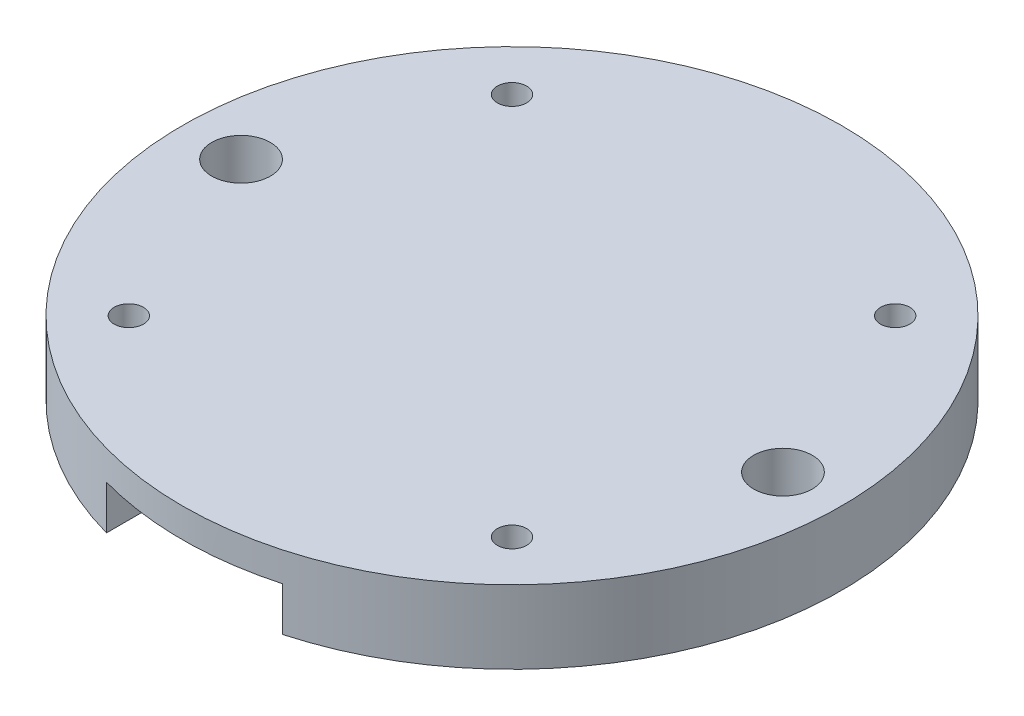
ISO-10303-21;
HEADER;
FILE_DESCRIPTION(('STEP AP214'),'2;1');
FILE_NAME('part.step','',(''),(''),'','','');
FILE_SCHEMA(('AUTOMOTIVE_DESIGN { 1 0 10303 214 1 1 1 1 }'));
ENDSEC;
DATA;
#1=APPLICATION_CONTEXT('core data for automotive mechanical design processes');
#2=APPLICATION_PROTOCOL_DEFINITION('international standard','automotive_design',2000,#1);
#3=PRODUCT_CONTEXT('',#1,'mechanical');
#4=PRODUCT('Part','Part','',(#3));
#5=PRODUCT_RELATED_PRODUCT_CATEGORY('part','',(#4));
#6=PRODUCT_DEFINITION_FORMATION('','',#4);
#7=PRODUCT_DEFINITION_CONTEXT('part definition',#1,'design');
#8=PRODUCT_DEFINITION('design','',#6,#7);
#9=PRODUCT_DEFINITION_SHAPE('','',#8);
#10=(LENGTH_UNIT() NAMED_UNIT(*) SI_UNIT(.MILLI.,.METRE.));
#11=(NAMED_UNIT(*) PLANE_ANGLE_UNIT() SI_UNIT($,.RADIAN.));
#12=(NAMED_UNIT(*) SI_UNIT($,.STERADIAN.) SOLID_ANGLE_UNIT());
#13=UNCERTAINTY_MEASURE_WITH_UNIT(LENGTH_MEASURE(1.E-05),#10,'distance_accuracy_value','');
#14=(GEOMETRIC_REPRESENTATION_CONTEXT(3) GLOBAL_UNCERTAINTY_ASSIGNED_CONTEXT((#13)) GLOBAL_UNIT_ASSIGNED_CONTEXT((#10,
#11,#12)) REPRESENTATION_CONTEXT('',''));
#15=CARTESIAN_POINT('',(0.,0.,0.));
#16=DIRECTION('',(0.,0.,1.));
#17=DIRECTION('',(1.,0.,0.));
#18=AXIS2_PLACEMENT_3D('',#15,#16,#17);
#19=CARTESIAN_POINT('',(0.,0.,0.));
#20=DIRECTION('',(0.,1.,0.));
#21=DIRECTION('',(0.,0.,1.));
#22=AXIS2_PLACEMENT_3D('',#19,#20,#21);
#23=PLANE('',#22);
#24=CARTESIAN_POINT('',(13.0814754519511,0.,13.0814754519512));
#25=DIRECTION('',(0.,1.,0.));
#26=DIRECTION('',(0.,0.,-1.));
#27=AXIS2_PLACEMENT_3D('',#24,#25,#26);
#28=CIRCLE('',#27,1.00000000000002);
#29=CARTESIAN_POINT('',(13.0814754519511,0.,12.0814754519511));
#30=VERTEX_POINT('',#29);
#31=EDGE_CURVE('E228',#30,#30,#28,.T.);
#32=ORIENTED_EDGE('',*,*,#31,.T.);
#33=EDGE_LOOP('',(#32));
#34=FACE_BOUND('',#33,.T.);
#35=CARTESIAN_POINT('',(13.0814754519511,0.,-13.0814754519512));
#36=DIRECTION('',(0.,1.,0.));
#37=DIRECTION('',(0.,0.,1.));
#38=AXIS2_PLACEMENT_3D('',#35,#36,#37);
#39=CIRCLE('',#38,1.00000000000002);
#40=CARTESIAN_POINT('',(13.0814754519511,0.,-12.0814754519511));
#41=VERTEX_POINT('',#40);
#42=EDGE_CURVE('E147',#41,#41,#39,.T.);
#43=ORIENTED_EDGE('',*,*,#42,.T.);
#44=EDGE_LOOP('',(#43));
#45=FACE_BOUND('',#44,.T.);
#46=CARTESIAN_POINT('',(18.5,0.,0.));
#47=DIRECTION('',(0.,1.,0.));
#48=DIRECTION('',(0.,0.,1.));
#49=AXIS2_PLACEMENT_3D('',#46,#47,#48);
#50=CIRCLE('',#49,2.);
#51=CARTESIAN_POINT('',(18.5,0.,2.));
#52=VERTEX_POINT('',#51);
#53=EDGE_CURVE('E126',#52,#52,#50,.T.);
#54=ORIENTED_EDGE('',*,*,#53,.T.);
#55=EDGE_LOOP('',(#54));
#56=FACE_BOUND('',#55,.T.);
#57=CARTESIAN_POINT('',(0.,0.,0.));
#58=DIRECTION('',(0.,1.,0.));
#59=DIRECTION('',(0.,0.,1.));
#60=AXIS2_PLACEMENT_3D('',#57,#58,#59);
#61=CIRCLE('',#60,22.5);
#62=CARTESIAN_POINT('',(6.,0.,21.6852484422014));
#63=VERTEX_POINT('',#62);
#64=CARTESIAN_POINT('',(6.,0.,-21.6852484422014));
#65=VERTEX_POINT('',#64);
#66=EDGE_CURVE('E120',#63,#65,#61,.T.);
#67=ORIENTED_EDGE('',*,*,#66,.F.);
#68=DIRECTION('',(0.,0.,1.));
#69=VECTOR('',#68,1.);
#70=CARTESIAN_POINT('',(6.,0.,-22.5));
#71=LINE('',#70,#69);
#72=CARTESIAN_POINT('',(6.,0.,8.31038506929733));
#73=VERTEX_POINT('',#72);
#74=EDGE_CURVE('E108',#73,#63,#71,.T.);
#75=ORIENTED_EDGE('',*,*,#74,.F.);
#76=CARTESIAN_POINT('',(0.,0.,0.));
#77=DIRECTION('',(0.,1.,0.));
#78=DIRECTION('',(0.,0.,1.));
#79=AXIS2_PLACEMENT_3D('',#76,#77,#78);
#80=CIRCLE('',#79,10.25);
#81=CARTESIAN_POINT('',(6.,0.,-8.31038506929733));
#82=VERTEX_POINT('',#81);
#83=EDGE_CURVE('E166',#73,#82,#80,.T.);
#84=ORIENTED_EDGE('',*,*,#83,.T.);
#85=EDGE_CURVE('E152',#65,#82,#71,.T.);
#86=ORIENTED_EDGE('',*,*,#85,.F.);
#87=EDGE_LOOP('',(#67,#75,#84,#86));
#88=FACE_BOUND('',#87,.T.);
#89=ADVANCED_FACE('F33',(#34,#45,#56,#88),#23,.F.);
#90=CARTESIAN_POINT('',(0.,1.,0.));
#91=DIRECTION('',(0.,-1.,0.));
#92=DIRECTION('',(0.,0.,-1.));
#93=AXIS2_PLACEMENT_3D('',#90,#91,#92);
#94=CYLINDRICAL_SURFACE('',#93,10.25);
#95=DIRECTION('',(0.,-1.,0.));
#96=VECTOR('',#95,1.);
#97=CARTESIAN_POINT('',(6.,1.,8.31038506929733));
#98=LINE('',#97,#96);
#99=CARTESIAN_POINT('',(6.,1.,8.31038506929733));
#100=VERTEX_POINT('',#99);
#101=EDGE_CURVE('E156',#100,#73,#98,.T.);
#102=ORIENTED_EDGE('',*,*,#101,.F.);
#103=CARTESIAN_POINT('',(0.,1.,0.));
#104=DIRECTION('',(0.,1.,0.));
#105=DIRECTION('',(0.,0.,1.));
#106=AXIS2_PLACEMENT_3D('',#103,#104,#105);
#107=CIRCLE('',#106,10.25);
#108=CARTESIAN_POINT('',(6.,1.,-8.31038506929733));
#109=VERTEX_POINT('',#108);
#110=EDGE_CURVE('E162',#100,#109,#107,.T.);
#111=ORIENTED_EDGE('',*,*,#110,.T.);
#112=DIRECTION('',(0.,-1.,0.));
#113=VECTOR('',#112,1.);
#114=CARTESIAN_POINT('',(6.,1.,-8.31038506929733));
#115=LINE('',#114,#113);
#116=EDGE_CURVE('E56',#82,#109,#115,.F.);
#117=ORIENTED_EDGE('',*,*,#116,.F.);
#118=ORIENTED_EDGE('',*,*,#83,.F.);
#119=EDGE_LOOP('',(#102,#111,#117,#118));
#120=FACE_BOUND('',#119,.T.);
#121=ADVANCED_FACE('F194',(#120),#94,.F.);
#122=CARTESIAN_POINT('',(0.,1.,0.));
#123=DIRECTION('',(0.,1.,0.));
#124=DIRECTION('',(0.,0.,1.));
#125=AXIS2_PLACEMENT_3D('',#122,#123,#124);
#126=PLANE('',#125);
#127=ORIENTED_EDGE('',*,*,#110,.F.);
#128=DIRECTION('',(0.,0.,-1.));
#129=VECTOR('',#128,1.);
#130=CARTESIAN_POINT('',(6.,1.,0.));
#131=LINE('',#130,#129);
#132=EDGE_CURVE('E132',#100,#109,#131,.T.);
#133=ORIENTED_EDGE('',*,*,#132,.T.);
#134=EDGE_LOOP('',(#127,#133));
#135=FACE_BOUND('',#134,.T.);
#136=ADVANCED_FACE('F199',(#135),#126,.F.);
#137=CARTESIAN_POINT('',(-13.0814754519511,0.,13.0814754519512));
#138=DIRECTION('',(0.,1.,0.));
#139=DIRECTION('',(0.,0.,1.));
#140=AXIS2_PLACEMENT_3D('',#137,#138,#139);
#141=CIRCLE('',#140,1.00000000000002);
#142=CARTESIAN_POINT('',(-13.0814754519511,0.,14.0814754519512));
#143=VERTEX_POINT('',#142);
#144=EDGE_CURVE('E216',#143,#143,#141,.T.);
#145=ORIENTED_EDGE('',*,*,#144,.T.);
#146=EDGE_LOOP('',(#145));
#147=FACE_BOUND('',#146,.T.);
#148=CARTESIAN_POINT('',(-13.0814754519511,0.,-13.0814754519512));
#149=DIRECTION('',(0.,1.,0.));
#150=DIRECTION('',(0.,0.,-1.));
#151=AXIS2_PLACEMENT_3D('',#148,#149,#150);
#152=CIRCLE('',#151,1.00000000000002);
#153=CARTESIAN_POINT('',(-13.0814754519511,0.,-14.0814754519512));
#154=VERTEX_POINT('',#153);
#155=EDGE_CURVE('E220',#154,#154,#152,.T.);
#156=ORIENTED_EDGE('',*,*,#155,.T.);
#157=EDGE_LOOP('',(#156));
#158=FACE_BOUND('',#157,.T.);
#159=CARTESIAN_POINT('',(-18.5,0.,0.));
#160=DIRECTION('',(0.,1.,0.));
#161=DIRECTION('',(0.,0.,-1.));
#162=AXIS2_PLACEMENT_3D('',#159,#160,#161);
#163=CIRCLE('',#162,2.);
#164=CARTESIAN_POINT('',(-18.5,0.,-2.));
#165=VERTEX_POINT('',#164);
#166=EDGE_CURVE('E164',#165,#165,#163,.T.);
#167=ORIENTED_EDGE('',*,*,#166,.T.);
#168=EDGE_LOOP('',(#167));
#169=FACE_BOUND('',#168,.T.);
#170=CARTESIAN_POINT('',(-6.,0.,-21.6852484422014));
#171=VERTEX_POINT('',#170);
#172=CARTESIAN_POINT('',(-6.,0.,21.6852484422014));
#173=VERTEX_POINT('',#172);
#174=EDGE_CURVE('E114',#171,#173,#61,.T.);
#175=ORIENTED_EDGE('',*,*,#174,.F.);
#176=DIRECTION('',(0.,0.,1.));
#177=VECTOR('',#176,1.);
#178=CARTESIAN_POINT('',(-6.,0.,-22.5));
#179=LINE('',#178,#177);
#180=CARTESIAN_POINT('',(-6.,0.,-8.31038506929734));
#181=VERTEX_POINT('',#180);
#182=EDGE_CURVE('E96',#171,#181,#179,.T.);
#183=ORIENTED_EDGE('',*,*,#182,.T.);
#184=CARTESIAN_POINT('',(-6.,0.,8.31038506929733));
#185=VERTEX_POINT('',#184);
#186=EDGE_CURVE('E161',#181,#185,#80,.T.);
#187=ORIENTED_EDGE('',*,*,#186,.T.);
#188=EDGE_CURVE('E109',#185,#173,#179,.T.);
#189=ORIENTED_EDGE('',*,*,#188,.T.);
#190=EDGE_LOOP('',(#175,#183,#187,#189));
#191=FACE_BOUND('',#190,.T.);
#192=ADVANCED_FACE('F119',(#147,#158,#169,#191),#23,.F.);
#193=CARTESIAN_POINT('',(0.,5.,0.));
#194=DIRECTION('',(0.,1.,0.));
#195=DIRECTION('',(0.,0.,1.));
#196=AXIS2_PLACEMENT_3D('',#193,#194,#195);
#197=PLANE('',#196);
#198=CARTESIAN_POINT('',(-13.0814754519511,5.,13.0814754519512));
#199=DIRECTION('',(0.,1.,0.));
#200=DIRECTION('',(0.,0.,1.));
#201=AXIS2_PLACEMENT_3D('',#198,#199,#200);
#202=CIRCLE('',#201,1.00000000000002);
#203=CARTESIAN_POINT('',(-13.0814754519511,5.,14.0814754519512));
#204=VERTEX_POINT('',#203);
#205=EDGE_CURVE('E233',#204,#204,#202,.T.);
#206=ORIENTED_EDGE('',*,*,#205,.F.);
#207=EDGE_LOOP('',(#206));
#208=FACE_BOUND('',#207,.T.);
#209=CARTESIAN_POINT('',(-13.0814754519511,5.,-13.0814754519512));
#210=DIRECTION('',(0.,1.,0.));
#211=DIRECTION('',(0.,0.,-1.));
#212=AXIS2_PLACEMENT_3D('',#209,#210,#211);
#213=CIRCLE('',#212,1.00000000000002);
#214=CARTESIAN_POINT('',(-13.0814754519511,5.,-14.0814754519512));
#215=VERTEX_POINT('',#214);
#216=EDGE_CURVE('E225',#215,#215,#213,.T.);
#217=ORIENTED_EDGE('',*,*,#216,.F.);
#218=EDGE_LOOP('',(#217));
#219=FACE_BOUND('',#218,.T.);
#220=CARTESIAN_POINT('',(13.0814754519511,5.,13.0814754519512));
#221=DIRECTION('',(0.,1.,0.));
#222=DIRECTION('',(0.,0.,-1.));
#223=AXIS2_PLACEMENT_3D('',#220,#221,#222);
#224=CIRCLE('',#223,1.00000000000002);
#225=CARTESIAN_POINT('',(13.0814754519511,5.,12.0814754519511));
#226=VERTEX_POINT('',#225);
#227=EDGE_CURVE('E224',#226,#226,#224,.T.);
#228=ORIENTED_EDGE('',*,*,#227,.F.);
#229=EDGE_LOOP('',(#228));
#230=FACE_BOUND('',#229,.T.);
#231=CARTESIAN_POINT('',(13.0814754519511,5.,-13.0814754519512));
#232=DIRECTION('',(0.,1.,0.));
#233=DIRECTION('',(0.,0.,1.));
#234=AXIS2_PLACEMENT_3D('',#231,#232,#233);
#235=CIRCLE('',#234,1.00000000000002);
#236=CARTESIAN_POINT('',(13.0814754519511,5.,-12.0814754519511));
#237=VERTEX_POINT('',#236);
#238=EDGE_CURVE('E236',#237,#237,#235,.T.);
#239=ORIENTED_EDGE('',*,*,#238,.F.);
#240=EDGE_LOOP('',(#239));
#241=FACE_BOUND('',#240,.T.);
#242=CARTESIAN_POINT('',(18.5,5.,0.));
#243=DIRECTION('',(0.,1.,0.));
#244=DIRECTION('',(0.,0.,1.));
#245=AXIS2_PLACEMENT_3D('',#242,#243,#244);
#246=CIRCLE('',#245,2.);
#247=CARTESIAN_POINT('',(18.5,5.,2.));
#248=VERTEX_POINT('',#247);
#249=EDGE_CURVE('E121',#248,#248,#246,.T.);
#250=ORIENTED_EDGE('',*,*,#249,.F.);
#251=EDGE_LOOP('',(#250));
#252=FACE_BOUND('',#251,.T.);
#253=CARTESIAN_POINT('',(0.,5.,0.));
#254=DIRECTION('',(0.,1.,0.));
#255=DIRECTION('',(0.,0.,1.));
#256=AXIS2_PLACEMENT_3D('',#253,#254,#255);
#257=CIRCLE('',#256,22.5);
#258=CARTESIAN_POINT('',(0.,5.,22.5));
#259=VERTEX_POINT('',#258);
#260=EDGE_CURVE('E124',#259,#259,#257,.T.);
#261=ORIENTED_EDGE('',*,*,#260,.T.);
#262=EDGE_LOOP('',(#261));
#263=FACE_BOUND('',#262,.T.);
#264=CARTESIAN_POINT('',(-18.5,5.,0.));
#265=DIRECTION('',(0.,1.,0.));
#266=DIRECTION('',(0.,0.,-1.));
#267=AXIS2_PLACEMENT_3D('',#264,#265,#266);
#268=CIRCLE('',#267,2.);
#269=CARTESIAN_POINT('',(-18.5,5.,-2.));
#270=VERTEX_POINT('',#269);
#271=EDGE_CURVE('E169',#270,#270,#268,.T.);
#272=ORIENTED_EDGE('',*,*,#271,.F.);
#273=EDGE_LOOP('',(#272));
#274=FACE_BOUND('',#273,.T.);
#275=ADVANCED_FACE('F190',(#208,#219,#230,#241,#252,#263,#274),#197,.T.);
#276=CARTESIAN_POINT('',(0.,5.,0.));
#277=DIRECTION('',(0.,-1.,0.));
#278=DIRECTION('',(0.,0.,-1.));
#279=AXIS2_PLACEMENT_3D('',#276,#277,#278);
#280=CYLINDRICAL_SURFACE('',#279,22.5);
#281=ORIENTED_EDGE('',*,*,#260,.F.);
#282=EDGE_LOOP('',(#281));
#283=FACE_BOUND('',#282,.T.);
#284=ORIENTED_EDGE('',*,*,#174,.T.);
#285=DIRECTION('',(0.,-1.,0.));
#286=VECTOR('',#285,1.);
#287=CARTESIAN_POINT('',(-6.,5.,21.6852484422014));
#288=LINE('',#287,#286);
#289=CARTESIAN_POINT('',(-5.99999999999999,3.,21.6852484422014));
#290=VERTEX_POINT('',#289);
#291=EDGE_CURVE('E116',#173,#290,#288,.F.);
#292=ORIENTED_EDGE('',*,*,#291,.T.);
#293=CARTESIAN_POINT('',(0.,3.,0.));
#294=DIRECTION('',(0.,1.,0.));
#295=DIRECTION('',(-1.,0.,0.));
#296=AXIS2_PLACEMENT_3D('',#293,#294,#295);
#297=CIRCLE('',#296,22.5);
#298=CARTESIAN_POINT('',(6.,3.,21.6852484422014));
#299=VERTEX_POINT('',#298);
#300=EDGE_CURVE('E37',#290,#299,#297,.T.);
#301=ORIENTED_EDGE('',*,*,#300,.T.);
#302=DIRECTION('',(0.,-1.,0.));
#303=VECTOR('',#302,1.);
#304=CARTESIAN_POINT('',(6.,5.,21.6852484422014));
#305=LINE('',#304,#303);
#306=EDGE_CURVE('E138',#299,#63,#305,.T.);
#307=ORIENTED_EDGE('',*,*,#306,.T.);
#308=ORIENTED_EDGE('',*,*,#66,.T.);
#309=DIRECTION('',(0.,-1.,0.));
#310=VECTOR('',#309,1.);
#311=CARTESIAN_POINT('',(6.,5.,-21.6852484422014));
#312=LINE('',#311,#310);
#313=CARTESIAN_POINT('',(6.,3.,-21.6852484422014));
#314=VERTEX_POINT('',#313);
#315=EDGE_CURVE('E158',#65,#314,#312,.F.);
#316=ORIENTED_EDGE('',*,*,#315,.T.);
#317=CARTESIAN_POINT('',(-5.99999999999999,3.,-21.6852484422014));
#318=VERTEX_POINT('',#317);
#319=EDGE_CURVE('E11',#314,#318,#297,.T.);
#320=ORIENTED_EDGE('',*,*,#319,.T.);
#321=DIRECTION('',(0.,-1.,0.));
#322=VECTOR('',#321,1.);
#323=CARTESIAN_POINT('',(-6.,5.,-21.6852484422014));
#324=LINE('',#323,#322);
#325=EDGE_CURVE('E100',#318,#171,#324,.T.);
#326=ORIENTED_EDGE('',*,*,#325,.T.);
#327=EDGE_LOOP('',(#284,#292,#301,#307,#308,#316,#320,#326));
#328=FACE_BOUND('',#327,.T.);
#329=ADVANCED_FACE('F35',(#283,#328),#280,.T.);
#330=CARTESIAN_POINT('',(18.5,5.,0.));
#331=DIRECTION('',(0.,-1.,0.));
#332=DIRECTION('',(0.,0.,-1.));
#333=AXIS2_PLACEMENT_3D('',#330,#331,#332);
#334=CYLINDRICAL_SURFACE('',#333,2.);
#335=ORIENTED_EDGE('',*,*,#249,.T.);
#336=EDGE_LOOP('',(#335));
#337=FACE_BOUND('',#336,.T.);
#338=ORIENTED_EDGE('',*,*,#53,.F.);
#339=EDGE_LOOP('',(#338));
#340=FACE_BOUND('',#339,.T.);
#341=ADVANCED_FACE('F178',(#337,#340),#334,.F.);
#342=CARTESIAN_POINT('',(-18.5,5.,0.));
#343=DIRECTION('',(0.,-1.,0.));
#344=DIRECTION('',(0.,0.,-1.));
#345=AXIS2_PLACEMENT_3D('',#342,#343,#344);
#346=CYLINDRICAL_SURFACE('',#345,2.);
#347=ORIENTED_EDGE('',*,*,#271,.T.);
#348=EDGE_LOOP('',(#347));
#349=FACE_BOUND('',#348,.T.);
#350=ORIENTED_EDGE('',*,*,#166,.F.);
#351=EDGE_LOOP('',(#350));
#352=FACE_BOUND('',#351,.T.);
#353=ADVANCED_FACE('F180',(#349,#352),#346,.F.);
#354=DIRECTION('',(0.,-1.,0.));
#355=VECTOR('',#354,1.);
#356=CARTESIAN_POINT('',(-6.,1.,-8.31038506929733));
#357=LINE('',#356,#355);
#358=CARTESIAN_POINT('',(-6.,1.,-8.31038506929733));
#359=VERTEX_POINT('',#358);
#360=EDGE_CURVE('E103',#359,#181,#357,.T.);
#361=ORIENTED_EDGE('',*,*,#360,.F.);
#362=CARTESIAN_POINT('',(-6.,1.,8.31038506929733));
#363=VERTEX_POINT('',#362);
#364=EDGE_CURVE('E165',#359,#363,#107,.T.);
#365=ORIENTED_EDGE('',*,*,#364,.T.);
#366=DIRECTION('',(0.,-1.,0.));
#367=VECTOR('',#366,1.);
#368=CARTESIAN_POINT('',(-6.,1.,8.31038506929733));
#369=LINE('',#368,#367);
#370=EDGE_CURVE('E48',#185,#363,#369,.F.);
#371=ORIENTED_EDGE('',*,*,#370,.F.);
#372=ORIENTED_EDGE('',*,*,#186,.F.);
#373=EDGE_LOOP('',(#361,#365,#371,#372));
#374=FACE_BOUND('',#373,.T.);
#375=ADVANCED_FACE('F187',(#374),#94,.F.);
#376=ORIENTED_EDGE('',*,*,#364,.F.);
#377=DIRECTION('',(0.,0.,1.));
#378=VECTOR('',#377,1.);
#379=CARTESIAN_POINT('',(-6.,1.,0.));
#380=LINE('',#379,#378);
#381=EDGE_CURVE('E131',#359,#363,#380,.T.);
#382=ORIENTED_EDGE('',*,*,#381,.T.);
#383=EDGE_LOOP('',(#376,#382));
#384=FACE_BOUND('',#383,.T.);
#385=ADVANCED_FACE('F212',(#384),#126,.F.);
#386=CARTESIAN_POINT('',(-6.,3.,-22.5));
#387=DIRECTION('',(0.,1.,0.));
#388=DIRECTION('',(-1.,0.,0.));
#389=AXIS2_PLACEMENT_3D('',#386,#387,#388);
#390=PLANE('',#389);
#391=DIRECTION('',(0.,0.,1.));
#392=VECTOR('',#391,1.);
#393=CARTESIAN_POINT('',(-6.,3.,-22.5));
#394=LINE('',#393,#392);
#395=EDGE_CURVE('E143',#318,#290,#394,.T.);
#396=ORIENTED_EDGE('',*,*,#395,.F.);
#397=ORIENTED_EDGE('',*,*,#319,.F.);
#398=DIRECTION('',(0.,0.,1.));
#399=VECTOR('',#398,1.);
#400=CARTESIAN_POINT('',(6.,3.,-22.5));
#401=LINE('',#400,#399);
#402=EDGE_CURVE('E145',#314,#299,#401,.T.);
#403=ORIENTED_EDGE('',*,*,#402,.T.);
#404=ORIENTED_EDGE('',*,*,#300,.F.);
#405=EDGE_LOOP('',(#396,#397,#403,#404));
#406=FACE_BOUND('',#405,.T.);
#407=ADVANCED_FACE('F142',(#406),#390,.F.);
#408=CARTESIAN_POINT('',(6.,0.,-22.5));
#409=DIRECTION('',(1.,0.,0.));
#410=DIRECTION('',(0.,0.,-1.));
#411=AXIS2_PLACEMENT_3D('',#408,#409,#410);
#412=PLANE('',#411);
#413=ORIENTED_EDGE('',*,*,#402,.F.);
#414=ORIENTED_EDGE('',*,*,#315,.F.);
#415=ORIENTED_EDGE('',*,*,#85,.T.);
#416=ORIENTED_EDGE('',*,*,#116,.T.);
#417=ORIENTED_EDGE('',*,*,#132,.F.);
#418=ORIENTED_EDGE('',*,*,#101,.T.);
#419=ORIENTED_EDGE('',*,*,#74,.T.);
#420=ORIENTED_EDGE('',*,*,#306,.F.);
#421=EDGE_LOOP('',(#413,#414,#415,#416,#417,#418,#419,#420));
#422=FACE_BOUND('',#421,.T.);
#423=ADVANCED_FACE('F243',(#422),#412,.F.);
#424=CARTESIAN_POINT('',(-6.,0.,-22.5));
#425=DIRECTION('',(-1.,0.,0.));
#426=DIRECTION('',(0.,0.,1.));
#427=AXIS2_PLACEMENT_3D('',#424,#425,#426);
#428=PLANE('',#427);
#429=ORIENTED_EDGE('',*,*,#395,.T.);
#430=ORIENTED_EDGE('',*,*,#291,.F.);
#431=ORIENTED_EDGE('',*,*,#188,.F.);
#432=ORIENTED_EDGE('',*,*,#370,.T.);
#433=ORIENTED_EDGE('',*,*,#381,.F.);
#434=ORIENTED_EDGE('',*,*,#360,.T.);
#435=ORIENTED_EDGE('',*,*,#182,.F.);
#436=ORIENTED_EDGE('',*,*,#325,.F.);
#437=EDGE_LOOP('',(#429,#430,#431,#432,#433,#434,#435,#436));
#438=FACE_BOUND('',#437,.T.);
#439=ADVANCED_FACE('F99',(#438),#428,.F.);
#440=CARTESIAN_POINT('',(13.0814754519511,0.,-13.0814754519512));
#441=DIRECTION('',(0.,1.,0.));
#442=DIRECTION('',(0.,0.,1.));
#443=AXIS2_PLACEMENT_3D('',#440,#441,#442);
#444=CYLINDRICAL_SURFACE('',#443,1.00000000000002);
#445=ORIENTED_EDGE('',*,*,#42,.F.);
#446=EDGE_LOOP('',(#445));
#447=FACE_BOUND('',#446,.T.);
#448=ORIENTED_EDGE('',*,*,#238,.T.);
#449=EDGE_LOOP('',(#448));
#450=FACE_BOUND('',#449,.T.);
#451=ADVANCED_FACE('F252',(#447,#450),#444,.F.);
#452=CARTESIAN_POINT('',(13.0814754519511,0.,13.0814754519512));
#453=DIRECTION('',(0.,1.,0.));
#454=DIRECTION('',(0.,0.,1.));
#455=AXIS2_PLACEMENT_3D('',#452,#453,#454);
#456=CYLINDRICAL_SURFACE('',#455,1.00000000000002);
#457=ORIENTED_EDGE('',*,*,#31,.F.);
#458=EDGE_LOOP('',(#457));
#459=FACE_BOUND('',#458,.T.);
#460=ORIENTED_EDGE('',*,*,#227,.T.);
#461=EDGE_LOOP('',(#460));
#462=FACE_BOUND('',#461,.T.);
#463=ADVANCED_FACE('F310',(#459,#462),#456,.F.);
#464=CARTESIAN_POINT('',(-13.0814754519511,0.,-13.0814754519512));
#465=DIRECTION('',(0.,1.,0.));
#466=DIRECTION('',(0.,0.,1.));
#467=AXIS2_PLACEMENT_3D('',#464,#465,#466);
#468=CYLINDRICAL_SURFACE('',#467,1.00000000000002);
#469=ORIENTED_EDGE('',*,*,#155,.F.);
#470=EDGE_LOOP('',(#469));
#471=FACE_BOUND('',#470,.T.);
#472=ORIENTED_EDGE('',*,*,#216,.T.);
#473=EDGE_LOOP('',(#472));
#474=FACE_BOUND('',#473,.T.);
#475=ADVANCED_FACE('F320',(#471,#474),#468,.F.);
#476=CARTESIAN_POINT('',(-13.0814754519511,0.,13.0814754519512));
#477=DIRECTION('',(0.,1.,0.));
#478=DIRECTION('',(0.,0.,1.));
#479=AXIS2_PLACEMENT_3D('',#476,#477,#478);
#480=CYLINDRICAL_SURFACE('',#479,1.00000000000002);
#481=ORIENTED_EDGE('',*,*,#144,.F.);
#482=EDGE_LOOP('',(#481));
#483=FACE_BOUND('',#482,.T.);
#484=ORIENTED_EDGE('',*,*,#205,.T.);
#485=EDGE_LOOP('',(#484));
#486=FACE_BOUND('',#485,.T.);
#487=ADVANCED_FACE('F330',(#483,#486),#480,.F.);
#488=CLOSED_SHELL('',(#89,#121,#136,#192,#275,#329,#341,#353,#375,#385,#407,#423,#439,#451,#463,
#475,#487));
#489=MANIFOLD_SOLID_BREP('B2',#488);
#490=ADVANCED_BREP_SHAPE_REPRESENTATION('',(#18,#489),#14);
#491=SHAPE_DEFINITION_REPRESENTATION(#9,#490);
ENDSEC;
END-ISO-10303-21;
